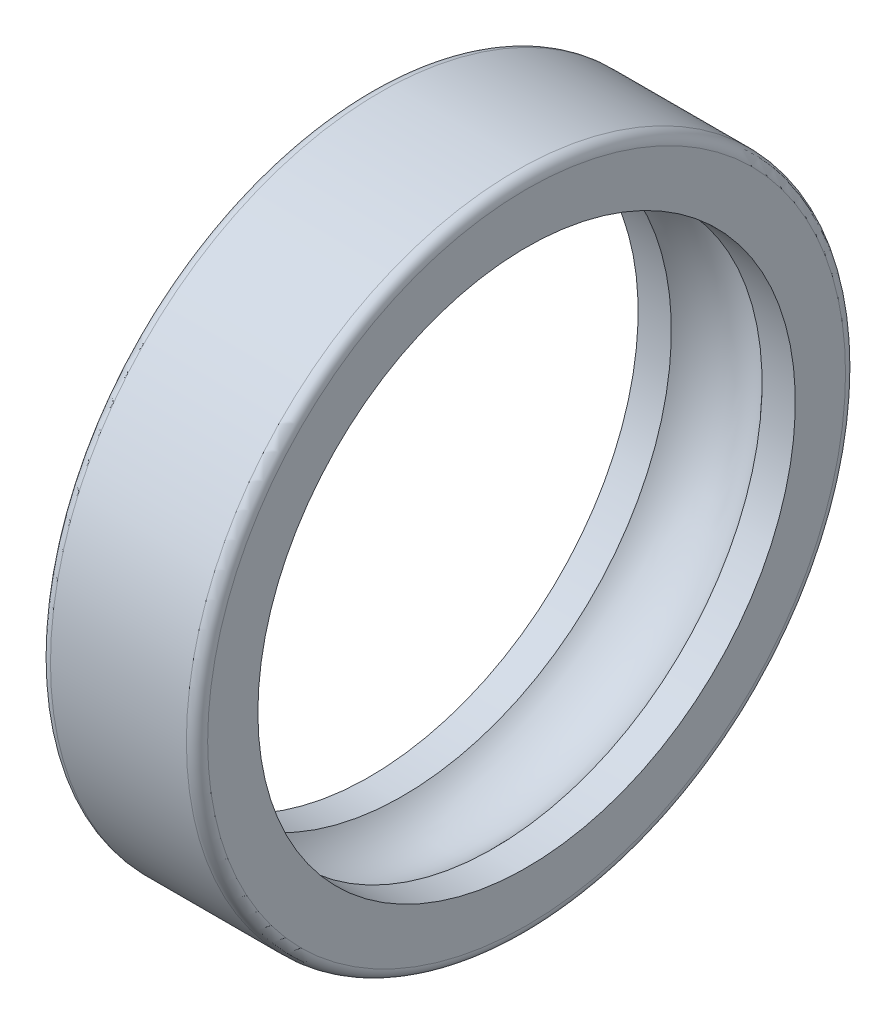
ISO-10303-21;
HEADER;
FILE_DESCRIPTION(('STEP AP214'),'2;1');
FILE_NAME('part.step','',(''),(''),'','','');
FILE_SCHEMA(('AUTOMOTIVE_DESIGN { 1 0 10303 214 1 1 1 1 }'));
ENDSEC;
DATA;
#1=APPLICATION_CONTEXT('core data for automotive mechanical design processes');
#2=APPLICATION_PROTOCOL_DEFINITION('international standard','automotive_design',2000,#1);
#3=PRODUCT_CONTEXT('',#1,'mechanical');
#4=PRODUCT('Part','Part','',(#3));
#5=PRODUCT_RELATED_PRODUCT_CATEGORY('part','',(#4));
#6=PRODUCT_DEFINITION_FORMATION('','',#4);
#7=PRODUCT_DEFINITION_CONTEXT('part definition',#1,'design');
#8=PRODUCT_DEFINITION('design','',#6,#7);
#9=PRODUCT_DEFINITION_SHAPE('','',#8);
#10=(LENGTH_UNIT() NAMED_UNIT(*) SI_UNIT(.MILLI.,.METRE.));
#11=(NAMED_UNIT(*) PLANE_ANGLE_UNIT() SI_UNIT($,.RADIAN.));
#12=(NAMED_UNIT(*) SI_UNIT($,.STERADIAN.) SOLID_ANGLE_UNIT());
#13=UNCERTAINTY_MEASURE_WITH_UNIT(LENGTH_MEASURE(1.E-05),#10,'distance_accuracy_value','');
#14=(GEOMETRIC_REPRESENTATION_CONTEXT(3) GLOBAL_UNCERTAINTY_ASSIGNED_CONTEXT((#13)) GLOBAL_UNIT_ASSIGNED_CONTEXT((#10,
#11,#12)) REPRESENTATION_CONTEXT('',''));
#15=CARTESIAN_POINT('',(0.,0.,0.));
#16=DIRECTION('',(0.,0.,1.));
#17=DIRECTION('',(1.,0.,0.));
#18=AXIS2_PLACEMENT_3D('',#15,#16,#17);
#19=CARTESIAN_POINT('',(-20.2526196060867,0.,0.));
#20=DIRECTION('',(-1.,0.,0.));
#21=DIRECTION('',(0.,0.,1.));
#22=AXIS2_PLACEMENT_3D('',#19,#20,#21);
#23=CYLINDRICAL_SURFACE('',#22,65.);
#24=CARTESIAN_POINT('',(-13.4,0.,0.));
#25=DIRECTION('',(1.,0.,0.));
#26=DIRECTION('',(0.,0.,-1.));
#27=AXIS2_PLACEMENT_3D('',#24,#25,#26);
#28=CIRCLE('',#27,65.);
#29=CARTESIAN_POINT('',(-13.4,0.,-65.));
#30=VERTEX_POINT('',#29);
#31=EDGE_CURVE('E49',#30,#30,#28,.T.);
#32=ORIENTED_EDGE('',*,*,#31,.T.);
#33=EDGE_LOOP('',(#32));
#34=FACE_BOUND('',#33,.T.);
#35=CARTESIAN_POINT('',(13.4,0.,0.));
#36=DIRECTION('',(1.,0.,0.));
#37=DIRECTION('',(0.,0.,-1.));
#38=AXIS2_PLACEMENT_3D('',#35,#36,#37);
#39=CIRCLE('',#38,65.);
#40=CARTESIAN_POINT('',(13.4,0.,-65.));
#41=VERTEX_POINT('',#40);
#42=EDGE_CURVE('E54',#41,#41,#39,.F.);
#43=ORIENTED_EDGE('',*,*,#42,.T.);
#44=EDGE_LOOP('',(#43));
#45=FACE_BOUND('',#44,.T.);
#46=ADVANCED_FACE('F41',(#34,#45),#23,.T.);
#47=CARTESIAN_POINT('',(15.5,65.,0.));
#48=DIRECTION('',(1.,0.,0.));
#49=DIRECTION('',(0.,0.,-1.));
#50=AXIS2_PLACEMENT_3D('',#47,#48,#49);
#51=PLANE('',#50);
#52=CARTESIAN_POINT('',(15.5,0.,0.));
#53=DIRECTION('',(1.,0.,0.));
#54=DIRECTION('',(0.,0.,-1.));
#55=AXIS2_PLACEMENT_3D('',#52,#53,#54);
#56=CIRCLE('',#55,62.9);
#57=CARTESIAN_POINT('',(15.5,0.,-62.9));
#58=VERTEX_POINT('',#57);
#59=EDGE_CURVE('E10',#58,#58,#56,.T.);
#60=ORIENTED_EDGE('',*,*,#59,.T.);
#61=EDGE_LOOP('',(#60));
#62=FACE_BOUND('',#61,.T.);
#63=CARTESIAN_POINT('',(15.5,0.,0.));
#64=DIRECTION('',(-1.,0.,0.));
#65=DIRECTION('',(0.,0.,1.));
#66=AXIS2_PLACEMENT_3D('',#63,#64,#65);
#67=CIRCLE('',#66,53.);
#68=CARTESIAN_POINT('',(15.5,0.,53.));
#69=VERTEX_POINT('',#68);
#70=EDGE_CURVE('E65',#69,#69,#67,.T.);
#71=ORIENTED_EDGE('',*,*,#70,.T.);
#72=EDGE_LOOP('',(#71));
#73=FACE_BOUND('',#72,.T.);
#74=ADVANCED_FACE('F98',(#62,#73),#51,.T.);
#75=CARTESIAN_POINT('',(-20.2526196060867,0.,0.));
#76=DIRECTION('',(-1.,0.,0.));
#77=DIRECTION('',(0.,0.,1.));
#78=AXIS2_PLACEMENT_3D('',#75,#76,#77);
#79=CYLINDRICAL_SURFACE('',#78,53.);
#80=ORIENTED_EDGE('',*,*,#70,.F.);
#81=EDGE_LOOP('',(#80));
#82=FACE_BOUND('',#81,.T.);
#83=CARTESIAN_POINT('',(8.94427190999915,0.,0.));
#84=DIRECTION('',(-1.,0.,0.));
#85=DIRECTION('',(0.,0.,1.));
#86=AXIS2_PLACEMENT_3D('',#83,#84,#85);
#87=CIRCLE('',#86,53.);
#88=CARTESIAN_POINT('',(8.94427190999915,0.,53.));
#89=VERTEX_POINT('',#88);
#90=EDGE_CURVE('E69',#89,#89,#87,.T.);
#91=ORIENTED_EDGE('',*,*,#90,.T.);
#92=EDGE_LOOP('',(#91));
#93=FACE_BOUND('',#92,.T.);
#94=ADVANCED_FACE('F103',(#82,#93),#79,.F.);
#95=CARTESIAN_POINT('',(0.,0.,0.));
#96=DIRECTION('',(-1.,0.,0.));
#97=DIRECTION('',(0.,0.,1.));
#98=AXIS2_PLACEMENT_3D('',#95,#96,#97);
#99=TOROIDAL_SURFACE('',#98,45.,12.);
#100=ORIENTED_EDGE('',*,*,#90,.F.);
#101=EDGE_LOOP('',(#100));
#102=FACE_BOUND('',#101,.T.);
#103=CARTESIAN_POINT('',(-8.94427190999915,0.,0.));
#104=DIRECTION('',(-1.,0.,0.));
#105=DIRECTION('',(0.,0.,1.));
#106=AXIS2_PLACEMENT_3D('',#103,#104,#105);
#107=CIRCLE('',#106,53.);
#108=CARTESIAN_POINT('',(-8.94427190999915,0.,53.));
#109=VERTEX_POINT('',#108);
#110=EDGE_CURVE('E73',#109,#109,#107,.T.);
#111=ORIENTED_EDGE('',*,*,#110,.T.);
#112=EDGE_LOOP('',(#111));
#113=FACE_BOUND('',#112,.T.);
#114=ADVANCED_FACE('F94',(#102,#113),#99,.F.);
#115=CARTESIAN_POINT('',(-20.2526196060867,0.,0.));
#116=DIRECTION('',(-1.,0.,0.));
#117=DIRECTION('',(0.,0.,1.));
#118=AXIS2_PLACEMENT_3D('',#115,#116,#117);
#119=CYLINDRICAL_SURFACE('',#118,53.);
#120=ORIENTED_EDGE('',*,*,#110,.F.);
#121=EDGE_LOOP('',(#120));
#122=FACE_BOUND('',#121,.T.);
#123=CARTESIAN_POINT('',(-15.5,0.,0.));
#124=DIRECTION('',(-1.,0.,0.));
#125=DIRECTION('',(0.,0.,1.));
#126=AXIS2_PLACEMENT_3D('',#123,#124,#125);
#127=CIRCLE('',#126,53.);
#128=CARTESIAN_POINT('',(-15.5,0.,53.));
#129=VERTEX_POINT('',#128);
#130=EDGE_CURVE('E77',#129,#129,#127,.T.);
#131=ORIENTED_EDGE('',*,*,#130,.T.);
#132=EDGE_LOOP('',(#131));
#133=FACE_BOUND('',#132,.T.);
#134=ADVANCED_FACE('F82',(#122,#133),#119,.F.);
#135=CARTESIAN_POINT('',(-15.5,65.,0.));
#136=DIRECTION('',(1.,0.,0.));
#137=DIRECTION('',(0.,0.,-1.));
#138=AXIS2_PLACEMENT_3D('',#135,#136,#137);
#139=PLANE('',#138);
#140=CARTESIAN_POINT('',(-15.5,0.,0.));
#141=DIRECTION('',(1.,0.,0.));
#142=DIRECTION('',(0.,0.,-1.));
#143=AXIS2_PLACEMENT_3D('',#140,#141,#142);
#144=CIRCLE('',#143,62.9);
#145=CARTESIAN_POINT('',(-15.5,0.,-62.9));
#146=VERTEX_POINT('',#145);
#147=EDGE_CURVE('E59',#146,#146,#144,.F.);
#148=ORIENTED_EDGE('',*,*,#147,.T.);
#149=EDGE_LOOP('',(#148));
#150=FACE_BOUND('',#149,.T.);
#151=ORIENTED_EDGE('',*,*,#130,.F.);
#152=EDGE_LOOP('',(#151));
#153=FACE_BOUND('',#152,.T.);
#154=ADVANCED_FACE('F84',(#150,#153),#139,.F.);
#155=CARTESIAN_POINT('',(-13.4,0.,0.));
#156=DIRECTION('',(1.,0.,0.));
#157=DIRECTION('',(0.,0.,-1.));
#158=AXIS2_PLACEMENT_3D('',#155,#156,#157);
#159=TOROIDAL_SURFACE('',#158,62.9,2.1);
#160=ORIENTED_EDGE('',*,*,#31,.F.);
#161=EDGE_LOOP('',(#160));
#162=FACE_BOUND('',#161,.T.);
#163=ORIENTED_EDGE('',*,*,#147,.F.);
#164=EDGE_LOOP('',(#163));
#165=FACE_BOUND('',#164,.T.);
#166=ADVANCED_FACE('F86',(#162,#165),#159,.T.);
#167=CARTESIAN_POINT('',(13.4,0.,0.));
#168=DIRECTION('',(1.,0.,0.));
#169=DIRECTION('',(0.,0.,-1.));
#170=AXIS2_PLACEMENT_3D('',#167,#168,#169);
#171=TOROIDAL_SURFACE('',#170,62.9,2.1);
#172=ORIENTED_EDGE('',*,*,#59,.F.);
#173=EDGE_LOOP('',(#172));
#174=FACE_BOUND('',#173,.T.);
#175=ORIENTED_EDGE('',*,*,#42,.F.);
#176=EDGE_LOOP('',(#175));
#177=FACE_BOUND('',#176,.T.);
#178=ADVANCED_FACE('F43',(#174,#177),#171,.T.);
#179=CLOSED_SHELL('',(#46,#74,#94,#114,#134,#154,#166,#178));
#180=MANIFOLD_SOLID_BREP('B2',#179);
#181=ADVANCED_BREP_SHAPE_REPRESENTATION('',(#18,#180),#14);
#182=SHAPE_DEFINITION_REPRESENTATION(#9,#181);
ENDSEC;
END-ISO-10303-21;
